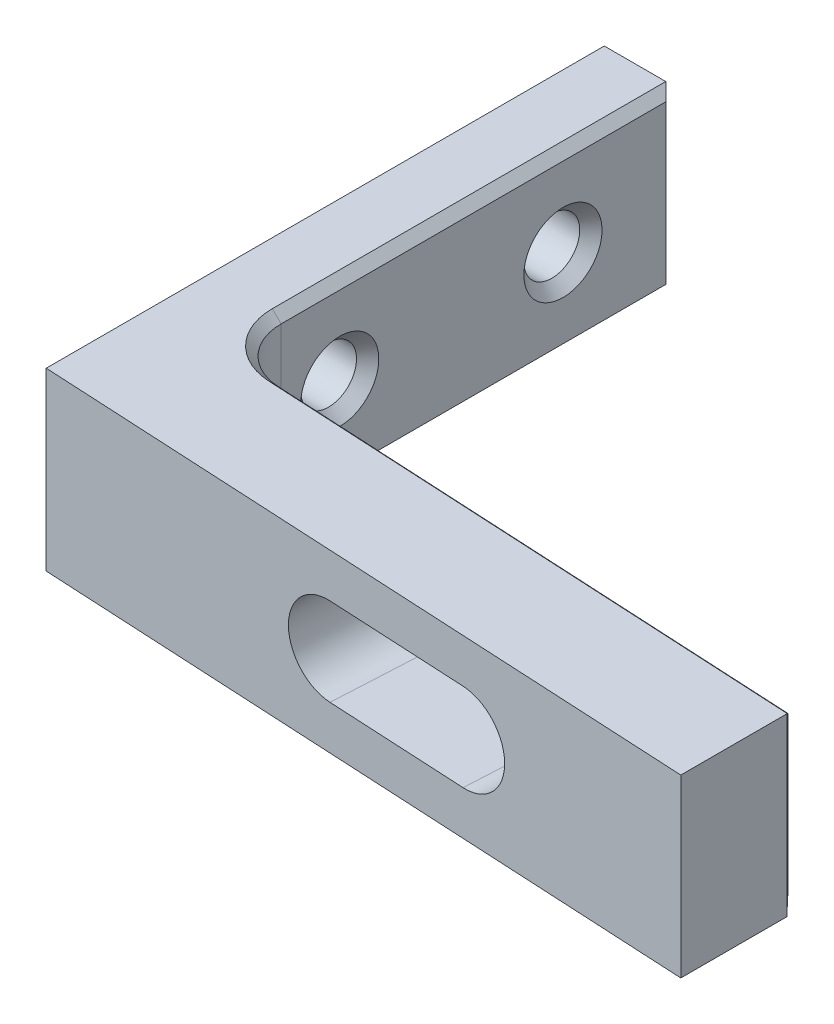
ISO-10303-21;
HEADER;
FILE_DESCRIPTION(('STEP AP214'),'2;1');
FILE_NAME('part.step','',(''),(''),'','','');
FILE_SCHEMA(('AUTOMOTIVE_DESIGN { 1 0 10303 214 1 1 1 1 }'));
ENDSEC;
DATA;
#1=APPLICATION_CONTEXT('core data for automotive mechanical design processes');
#2=APPLICATION_PROTOCOL_DEFINITION('international standard','automotive_design',2000,#1);
#3=PRODUCT_CONTEXT('',#1,'mechanical');
#4=PRODUCT('Part','Part','',(#3));
#5=PRODUCT_RELATED_PRODUCT_CATEGORY('part','',(#4));
#6=PRODUCT_DEFINITION_FORMATION('','',#4);
#7=PRODUCT_DEFINITION_CONTEXT('part definition',#1,'design');
#8=PRODUCT_DEFINITION('design','',#6,#7);
#9=PRODUCT_DEFINITION_SHAPE('','',#8);
#10=(LENGTH_UNIT() NAMED_UNIT(*) SI_UNIT(.MILLI.,.METRE.));
#11=(NAMED_UNIT(*) PLANE_ANGLE_UNIT() SI_UNIT($,.RADIAN.));
#12=(NAMED_UNIT(*) SI_UNIT($,.STERADIAN.) SOLID_ANGLE_UNIT());
#13=UNCERTAINTY_MEASURE_WITH_UNIT(LENGTH_MEASURE(1.E-05),#10,'distance_accuracy_value','');
#14=(GEOMETRIC_REPRESENTATION_CONTEXT(3) GLOBAL_UNCERTAINTY_ASSIGNED_CONTEXT((#13)) GLOBAL_UNIT_ASSIGNED_CONTEXT((#10,
#11,#12)) REPRESENTATION_CONTEXT('',''));
#15=CARTESIAN_POINT('',(0.,0.,0.));
#16=DIRECTION('',(0.,0.,1.));
#17=DIRECTION('',(1.,0.,0.));
#18=AXIS2_PLACEMENT_3D('',#15,#16,#17);
#19=CARTESIAN_POINT('',(19.05,10.,15.875));
#20=DIRECTION('',(-1.,0.,0.));
#21=DIRECTION('',(0.,0.,1.));
#22=AXIS2_PLACEMENT_3D('',#19,#20,#21);
#23=PLANE('',#22);
#24=DIRECTION('',(0.,0.,-1.));
#25=VECTOR('',#24,1.);
#26=CARTESIAN_POINT('',(19.05,0.,15.875));
#27=LINE('',#26,#25);
#28=CARTESIAN_POINT('',(19.05,0.,17.8717363906839));
#29=VERTEX_POINT('',#28);
#30=CARTESIAN_POINT('',(19.05,0.,11.8404825249185));
#31=VERTEX_POINT('',#30);
#32=EDGE_CURVE('E211',#29,#31,#27,.T.);
#33=ORIENTED_EDGE('',*,*,#32,.T.);
#34=DIRECTION('',(0.,1.,0.));
#35=VECTOR('',#34,1.);
#36=CARTESIAN_POINT('',(19.05,10.,11.8404825249185));
#37=LINE('',#36,#35);
#38=CARTESIAN_POINT('',(19.05,10.,11.8404825249185));
#39=VERTEX_POINT('',#38);
#40=EDGE_CURVE('E40',#31,#39,#37,.T.);
#41=ORIENTED_EDGE('',*,*,#40,.T.);
#42=DIRECTION('',(0.,0.,-1.));
#43=VECTOR('',#42,1.);
#44=CARTESIAN_POINT('',(19.05,10.,15.875));
#45=LINE('',#44,#43);
#46=CARTESIAN_POINT('',(19.05,10.,17.8717363906839));
#47=VERTEX_POINT('',#46);
#48=EDGE_CURVE('E212',#47,#39,#45,.T.);
#49=ORIENTED_EDGE('',*,*,#48,.F.);
#50=DIRECTION('',(0.,1.,0.));
#51=VECTOR('',#50,1.);
#52=CARTESIAN_POINT('',(19.05,10.,17.8717363906839));
#53=LINE('',#52,#51);
#54=EDGE_CURVE('E231',#47,#29,#53,.F.);
#55=ORIENTED_EDGE('',*,*,#54,.T.);
#56=EDGE_LOOP('',(#33,#41,#49,#55));
#57=FACE_BOUND('',#56,.T.);
#58=ADVANCED_FACE('F31',(#57),#23,.F.);
#59=CARTESIAN_POINT('',(-19.05,10.,-15.875));
#60=DIRECTION('',(0.,0.,1.));
#61=DIRECTION('',(1.,0.,0.));
#62=AXIS2_PLACEMENT_3D('',#59,#60,#61);
#63=PLANE('',#62);
#64=DIRECTION('',(-1.,0.,0.));
#65=VECTOR('',#64,1.);
#66=CARTESIAN_POINT('',(-19.05,10.,-15.875));
#67=LINE('',#66,#65);
#68=CARTESIAN_POINT('',(-15.55,10.,-15.875));
#69=VERTEX_POINT('',#68);
#70=CARTESIAN_POINT('',(-19.05,10.,-15.875));
#71=VERTEX_POINT('',#70);
#72=EDGE_CURVE('E215',#69,#71,#67,.T.);
#73=ORIENTED_EDGE('',*,*,#72,.F.);
#74=DIRECTION('',(0.,-1.,0.));
#75=VECTOR('',#74,1.);
#76=CARTESIAN_POINT('',(-15.55,10.,-15.875));
#77=LINE('',#76,#75);
#78=CARTESIAN_POINT('',(-15.55,0.,-15.875));
#79=VERTEX_POINT('',#78);
#80=EDGE_CURVE('E11',#69,#79,#77,.T.);
#81=ORIENTED_EDGE('',*,*,#80,.T.);
#82=DIRECTION('',(-1.,0.,0.));
#83=VECTOR('',#82,1.);
#84=CARTESIAN_POINT('',(-19.05,0.,-15.875));
#85=LINE('',#84,#83);
#86=CARTESIAN_POINT('',(-19.05,0.,-15.875));
#87=VERTEX_POINT('',#86);
#88=EDGE_CURVE('E223',#79,#87,#85,.T.);
#89=ORIENTED_EDGE('',*,*,#88,.T.);
#90=DIRECTION('',(0.,-1.,0.));
#91=VECTOR('',#90,1.);
#92=CARTESIAN_POINT('',(-19.05,10.,-15.875));
#93=LINE('',#92,#91);
#94=EDGE_CURVE('E230',#71,#87,#93,.T.);
#95=ORIENTED_EDGE('',*,*,#94,.F.);
#96=EDGE_LOOP('',(#73,#81,#89,#95));
#97=FACE_BOUND('',#96,.T.);
#98=ADVANCED_FACE('F367',(#97),#63,.F.);
#99=CARTESIAN_POINT('',(-19.05,10.,15.875));
#100=DIRECTION('',(1.,0.,0.));
#101=DIRECTION('',(0.,0.,-1.));
#102=AXIS2_PLACEMENT_3D('',#99,#100,#101);
#103=PLANE('',#102);
#104=CARTESIAN_POINT('',(-19.05,5.,-9.525));
#105=DIRECTION('',(-1.,0.,0.));
#106=DIRECTION('',(0.,0.,1.));
#107=AXIS2_PLACEMENT_3D('',#104,#105,#106);
#108=CIRCLE('',#107,2.2225);
#109=CARTESIAN_POINT('',(-19.05,5.,-7.3025));
#110=VERTEX_POINT('',#109);
#111=EDGE_CURVE('E186',#110,#110,#108,.T.);
#112=ORIENTED_EDGE('',*,*,#111,.F.);
#113=EDGE_LOOP('',(#112));
#114=FACE_BOUND('',#113,.T.);
#115=CARTESIAN_POINT('',(-19.05,5.,3.175));
#116=DIRECTION('',(-1.,0.,0.));
#117=DIRECTION('',(0.,0.,1.));
#118=AXIS2_PLACEMENT_3D('',#115,#116,#117);
#119=CIRCLE('',#118,2.2225);
#120=CARTESIAN_POINT('',(-19.05,5.,5.3975));
#121=VERTEX_POINT('',#120);
#122=EDGE_CURVE('E202',#121,#121,#119,.T.);
#123=ORIENTED_EDGE('',*,*,#122,.F.);
#124=EDGE_LOOP('',(#123));
#125=FACE_BOUND('',#124,.T.);
#126=DIRECTION('',(0.,0.,1.));
#127=VECTOR('',#126,1.);
#128=CARTESIAN_POINT('',(-19.05,0.,15.875));
#129=LINE('',#128,#127);
#130=CARTESIAN_POINT('',(-19.05,0.,15.875));
#131=VERTEX_POINT('',#130);
#132=EDGE_CURVE('E225',#87,#131,#129,.T.);
#133=ORIENTED_EDGE('',*,*,#132,.T.);
#134=DIRECTION('',(0.,-1.,0.));
#135=VECTOR('',#134,1.);
#136=CARTESIAN_POINT('',(-19.05,10.,15.875));
#137=LINE('',#136,#135);
#138=CARTESIAN_POINT('',(-19.05,10.,15.875));
#139=VERTEX_POINT('',#138);
#140=EDGE_CURVE('E227',#139,#131,#137,.T.);
#141=ORIENTED_EDGE('',*,*,#140,.F.);
#142=DIRECTION('',(0.,0.,1.));
#143=VECTOR('',#142,1.);
#144=CARTESIAN_POINT('',(-19.05,10.,15.875));
#145=LINE('',#144,#143);
#146=EDGE_CURVE('E218',#71,#139,#145,.T.);
#147=ORIENTED_EDGE('',*,*,#146,.F.);
#148=ORIENTED_EDGE('',*,*,#94,.T.);
#149=EDGE_LOOP('',(#133,#141,#147,#148));
#150=FACE_BOUND('',#149,.T.);
#151=ADVANCED_FACE('F376',(#114,#125,#150),#103,.F.);
#152=CARTESIAN_POINT('',(-19.05,10.,15.875));
#153=DIRECTION('',(-0.0523359562429439,0.,0.998629534754574));
#154=DIRECTION('',(0.998629534754574,0.,0.052335956242944));
#155=AXIS2_PLACEMENT_3D('',#152,#153,#154);
#156=PLANE('',#155);
#157=DIRECTION('',(-0.998629534754574,0.,-0.052335956242944));
#158=VECTOR('',#157,1.);
#159=CARTESIAN_POINT('',(-19.05,7.5,15.875));
#160=LINE('',#159,#158);
#161=CARTESIAN_POINT('',(-2.01119831442696,7.5,16.767965757985));
#162=VERTEX_POINT('',#161);
#163=CARTESIAN_POINT('',(5.97783796360963,7.5,17.1866534079286));
#164=VERTEX_POINT('',#163);
#165=EDGE_CURVE('E182',#162,#164,#160,.F.);
#166=ORIENTED_EDGE('',*,*,#165,.T.);
#167=CARTESIAN_POINT('',(5.97783796360963,5.,17.1866534079286));
#168=DIRECTION('',(-0.0523359562429439,0.,0.998629534754574));
#169=DIRECTION('',(0.998629534754574,0.,0.052335956242944));
#170=AXIS2_PLACEMENT_3D('',#167,#168,#169);
#171=CIRCLE('',#170,2.5);
#172=CARTESIAN_POINT('',(5.97783796360963,2.5,17.1866534079286));
#173=VERTEX_POINT('',#172);
#174=EDGE_CURVE('E173',#164,#173,#171,.F.);
#175=ORIENTED_EDGE('',*,*,#174,.T.);
#176=DIRECTION('',(0.998629534754574,0.,0.052335956242944));
#177=VECTOR('',#176,1.);
#178=CARTESIAN_POINT('',(-19.05,2.5,15.875));
#179=LINE('',#178,#177);
#180=CARTESIAN_POINT('',(-2.01119831442696,2.5,16.767965757985));
#181=VERTEX_POINT('',#180);
#182=EDGE_CURVE('E156',#173,#181,#179,.F.);
#183=ORIENTED_EDGE('',*,*,#182,.T.);
#184=CARTESIAN_POINT('',(-2.01119831442696,5.,16.767965757985));
#185=DIRECTION('',(-0.0523359562429439,0.,0.998629534754574));
#186=DIRECTION('',(0.998629534754574,0.,0.052335956242944));
#187=AXIS2_PLACEMENT_3D('',#184,#185,#186);
#188=CIRCLE('',#187,2.5);
#189=EDGE_CURVE('E167',#181,#162,#188,.F.);
#190=ORIENTED_EDGE('',*,*,#189,.T.);
#191=EDGE_LOOP('',(#166,#175,#183,#190));
#192=FACE_BOUND('',#191,.T.);
#193=DIRECTION('',(-0.998629534754574,0.,-0.052335956242944));
#194=VECTOR('',#193,1.);
#195=CARTESIAN_POINT('',(17.2862527523916,0.,17.7793023142201));
#196=LINE('',#195,#194);
#197=EDGE_CURVE('E216',#131,#29,#196,.F.);
#198=ORIENTED_EDGE('',*,*,#197,.T.);
#199=ORIENTED_EDGE('',*,*,#54,.F.);
#200=DIRECTION('',(-0.998629534754574,0.,-0.052335956242944));
#201=VECTOR('',#200,1.);
#202=CARTESIAN_POINT('',(17.2862527523916,10.,17.7793023142201));
#203=LINE('',#202,#201);
#204=EDGE_CURVE('E220',#139,#47,#203,.F.);
#205=ORIENTED_EDGE('',*,*,#204,.F.);
#206=ORIENTED_EDGE('',*,*,#140,.T.);
#207=EDGE_LOOP('',(#198,#199,#205,#206));
#208=FACE_BOUND('',#207,.T.);
#209=ADVANCED_FACE('F180',(#192,#208),#156,.T.);
#210=CARTESIAN_POINT('',(19.05,10.,-15.875));
#211=DIRECTION('',(0.,-1.,0.));
#212=DIRECTION('',(0.,0.,-1.));
#213=AXIS2_PLACEMENT_3D('',#210,#211,#212);
#214=PLANE('',#213);
#215=CARTESIAN_POINT('',(-11.875,10.,6.51203750068026));
#216=DIRECTION('',(0.,-1.,0.));
#217=DIRECTION('',(0.,0.,-1.));
#218=AXIS2_PLACEMENT_3D('',#215,#216,#217);
#219=CIRCLE('',#218,3.675);
#220=CARTESIAN_POINT('',(-12.0673346391928,10.,10.1820010409033));
#221=VERTEX_POINT('',#220);
#222=CARTESIAN_POINT('',(-15.55,10.,6.51203750068026));
#223=VERTEX_POINT('',#222);
#224=EDGE_CURVE('E48',#221,#223,#219,.T.);
#225=ORIENTED_EDGE('',*,*,#224,.T.);
#226=DIRECTION('',(0.,0.,-1.));
#227=VECTOR('',#226,1.);
#228=CARTESIAN_POINT('',(-15.55,10.,-15.875));
#229=LINE('',#228,#227);
#230=EDGE_CURVE('E300',#223,#69,#229,.T.);
#231=ORIENTED_EDGE('',*,*,#230,.T.);
#232=ORIENTED_EDGE('',*,*,#72,.T.);
#233=ORIENTED_EDGE('',*,*,#146,.T.);
#234=ORIENTED_EDGE('',*,*,#204,.T.);
#235=ORIENTED_EDGE('',*,*,#48,.T.);
#236=DIRECTION('',(0.669130606358862,0.,0.743144825477391));
#237=VECTOR('',#236,1.);
#238=CARTESIAN_POINT('',(19.05,10.,11.8404825249185));
#239=LINE('',#238,#237);
#240=CARTESIAN_POINT('',(19.0238320218785,10.,11.811420040929));
#241=VERTEX_POINT('',#240);
#242=EDGE_CURVE('E296',#39,#241,#239,.F.);
#243=ORIENTED_EDGE('',*,*,#242,.T.);
#244=DIRECTION('',(-0.998629534754574,0.,-0.0523359562429439));
#245=VECTOR('',#244,1.);
#246=CARTESIAN_POINT('',(17.6029188544084,10.,11.7369531372679));
#247=LINE('',#246,#245);
#248=EDGE_CURVE('E53',#241,#221,#247,.T.);
#249=ORIENTED_EDGE('',*,*,#248,.T.);
#250=EDGE_LOOP('',(#225,#231,#232,#233,#234,#235,#243,#249));
#251=FACE_BOUND('',#250,.T.);
#252=ADVANCED_FACE('F381',(#251),#214,.F.);
#253=CARTESIAN_POINT('',(19.05,0.,-15.875));
#254=DIRECTION('',(0.,-1.,0.));
#255=DIRECTION('',(0.,0.,-1.));
#256=AXIS2_PLACEMENT_3D('',#253,#254,#255);
#257=PLANE('',#256);
#258=ORIENTED_EDGE('',*,*,#88,.F.);
#259=DIRECTION('',(0.,0.,1.));
#260=VECTOR('',#259,1.);
#261=CARTESIAN_POINT('',(-15.55,0.,6.51203750068026));
#262=LINE('',#261,#260);
#263=CARTESIAN_POINT('',(-15.55,0.,6.51203750068026));
#264=VERTEX_POINT('',#263);
#265=EDGE_CURVE('E276',#79,#264,#262,.T.);
#266=ORIENTED_EDGE('',*,*,#265,.T.);
#267=CARTESIAN_POINT('',(-11.875,0.,6.51203750068026));
#268=DIRECTION('',(0.,-1.,0.));
#269=DIRECTION('',(0.,0.,-1.));
#270=AXIS2_PLACEMENT_3D('',#267,#268,#269);
#271=CIRCLE('',#270,3.67499999999999);
#272=CARTESIAN_POINT('',(-12.0673346391928,0.,10.1820010409033));
#273=VERTEX_POINT('',#272);
#274=EDGE_CURVE('E274',#264,#273,#271,.F.);
#275=ORIENTED_EDGE('',*,*,#274,.T.);
#276=DIRECTION('',(0.998629534754574,0.,0.0523359562429439));
#277=VECTOR('',#276,1.);
#278=CARTESIAN_POINT('',(19.0238320218785,0.,11.811420040929));
#279=LINE('',#278,#277);
#280=CARTESIAN_POINT('',(19.0238320218785,0.,11.811420040929));
#281=VERTEX_POINT('',#280);
#282=EDGE_CURVE('E272',#273,#281,#279,.T.);
#283=ORIENTED_EDGE('',*,*,#282,.T.);
#284=DIRECTION('',(-0.669130606358862,0.,-0.743144825477391));
#285=VECTOR('',#284,1.);
#286=CARTESIAN_POINT('',(5.26817289413589,0.,-3.46578713606626));
#287=LINE('',#286,#285);
#288=EDGE_CURVE('E261',#281,#31,#287,.F.);
#289=ORIENTED_EDGE('',*,*,#288,.T.);
#290=ORIENTED_EDGE('',*,*,#32,.F.);
#291=ORIENTED_EDGE('',*,*,#197,.F.);
#292=ORIENTED_EDGE('',*,*,#132,.F.);
#293=EDGE_LOOP('',(#258,#266,#275,#283,#289,#290,#291,#292));
#294=FACE_BOUND('',#293,.T.);
#295=ADVANCED_FACE('F371',(#294),#257,.T.);
#296=CARTESIAN_POINT('',(-15.05,-0.000999999999999265,-15.875));
#297=DIRECTION('',(-1.,0.,0.));
#298=DIRECTION('',(0.,0.,1.));
#299=AXIS2_PLACEMENT_3D('',#296,#297,#298);
#300=PLANE('',#299);
#301=DIRECTION('',(0.,1.,0.));
#302=VECTOR('',#301,1.);
#303=CARTESIAN_POINT('',(-15.05,0.,6.51203750068026));
#304=LINE('',#303,#302);
#305=CARTESIAN_POINT('',(-15.05,9.5,6.51203750068026));
#306=VERTEX_POINT('',#305);
#307=CARTESIAN_POINT('',(-15.05,0.499999999999987,6.51203750068026));
#308=VERTEX_POINT('',#307);
#309=EDGE_CURVE('E241',#306,#308,#304,.F.);
#310=ORIENTED_EDGE('',*,*,#309,.T.);
#311=DIRECTION('',(0.,0.,-1.));
#312=VECTOR('',#311,1.);
#313=CARTESIAN_POINT('',(-15.05,0.499999999999987,-15.875));
#314=LINE('',#313,#312);
#315=CARTESIAN_POINT('',(-15.05,0.499999999999987,-15.375));
#316=VERTEX_POINT('',#315);
#317=EDGE_CURVE('E283',#308,#316,#314,.T.);
#318=ORIENTED_EDGE('',*,*,#317,.T.);
#319=DIRECTION('',(0.,1.,0.));
#320=VECTOR('',#319,1.);
#321=CARTESIAN_POINT('',(-15.05,-0.000999999999999265,-15.375));
#322=LINE('',#321,#320);
#323=CARTESIAN_POINT('',(-15.05,9.5,-15.375));
#324=VERTEX_POINT('',#323);
#325=EDGE_CURVE('E279',#316,#324,#322,.T.);
#326=ORIENTED_EDGE('',*,*,#325,.T.);
#327=DIRECTION('',(0.,0.,1.));
#328=VECTOR('',#327,1.);
#329=CARTESIAN_POINT('',(-15.05,9.5,-15.875));
#330=LINE('',#329,#328);
#331=EDGE_CURVE('E281',#324,#306,#330,.T.);
#332=ORIENTED_EDGE('',*,*,#331,.T.);
#333=EDGE_LOOP('',(#310,#318,#326,#332));
#334=FACE_BOUND('',#333,.T.);
#335=CARTESIAN_POINT('',(-15.05,5.,-9.525));
#336=DIRECTION('',(-1.,0.,0.));
#337=DIRECTION('',(0.,0.,1.));
#338=AXIS2_PLACEMENT_3D('',#335,#336,#337);
#339=CIRCLE('',#338,2.2225);
#340=CARTESIAN_POINT('',(-15.05,5.,-7.3025));
#341=VERTEX_POINT('',#340);
#342=EDGE_CURVE('E183',#341,#341,#339,.T.);
#343=ORIENTED_EDGE('',*,*,#342,.T.);
#344=EDGE_LOOP('',(#343));
#345=FACE_BOUND('',#344,.T.);
#346=CARTESIAN_POINT('',(-15.05,5.,3.175));
#347=DIRECTION('',(-1.,0.,0.));
#348=DIRECTION('',(0.,0.,1.));
#349=AXIS2_PLACEMENT_3D('',#346,#347,#348);
#350=CIRCLE('',#349,2.2225);
#351=CARTESIAN_POINT('',(-15.05,5.,5.3975));
#352=VERTEX_POINT('',#351);
#353=EDGE_CURVE('E199',#352,#352,#350,.T.);
#354=ORIENTED_EDGE('',*,*,#353,.T.);
#355=EDGE_LOOP('',(#354));
#356=FACE_BOUND('',#355,.T.);
#357=ADVANCED_FACE('F354',(#334,#345,#356),#300,.F.);
#358=CARTESIAN_POINT('',(-15.685,5.,3.175));
#359=DIRECTION('',(1.,0.,0.));
#360=DIRECTION('',(0.,0.,-1.));
#361=AXIS2_PLACEMENT_3D('',#358,#359,#360);
#362=CONICAL_SURFACE('',#361,1.5875,0.785398163397448);
#363=ORIENTED_EDGE('',*,*,#353,.F.);
#364=EDGE_LOOP('',(#363));
#365=FACE_BOUND('',#364,.T.);
#366=CARTESIAN_POINT('',(-15.685,5.,3.175));
#367=DIRECTION('',(-1.,0.,0.));
#368=DIRECTION('',(0.,0.,1.));
#369=AXIS2_PLACEMENT_3D('',#366,#367,#368);
#370=CIRCLE('',#369,1.5875);
#371=CARTESIAN_POINT('',(-15.685,5.,4.7625));
#372=VERTEX_POINT('',#371);
#373=EDGE_CURVE('E208',#372,#372,#370,.T.);
#374=ORIENTED_EDGE('',*,*,#373,.T.);
#375=EDGE_LOOP('',(#374));
#376=FACE_BOUND('',#375,.T.);
#377=ADVANCED_FACE('F531',(#365,#376),#362,.F.);
#378=CARTESIAN_POINT('',(-19.05,5.,3.175));
#379=DIRECTION('',(-1.,0.,0.));
#380=DIRECTION('',(0.,0.,1.));
#381=AXIS2_PLACEMENT_3D('',#378,#379,#380);
#382=CYLINDRICAL_SURFACE('',#381,1.5875);
#383=ORIENTED_EDGE('',*,*,#373,.F.);
#384=EDGE_LOOP('',(#383));
#385=FACE_BOUND('',#384,.T.);
#386=CARTESIAN_POINT('',(-18.415,5.,3.175));
#387=DIRECTION('',(-1.,0.,0.));
#388=DIRECTION('',(0.,0.,1.));
#389=AXIS2_PLACEMENT_3D('',#386,#387,#388);
#390=CIRCLE('',#389,1.5875);
#391=CARTESIAN_POINT('',(-18.415,5.,4.7625));
#392=VERTEX_POINT('',#391);
#393=EDGE_CURVE('E205',#392,#392,#390,.T.);
#394=ORIENTED_EDGE('',*,*,#393,.T.);
#395=EDGE_LOOP('',(#394));
#396=FACE_BOUND('',#395,.T.);
#397=ADVANCED_FACE('F523',(#385,#396),#382,.F.);
#398=CARTESIAN_POINT('',(-19.05,5.,3.175));
#399=DIRECTION('',(-1.,0.,0.));
#400=DIRECTION('',(0.,0.,1.));
#401=AXIS2_PLACEMENT_3D('',#398,#399,#400);
#402=CONICAL_SURFACE('',#401,2.2225,0.785398163397448);
#403=ORIENTED_EDGE('',*,*,#393,.F.);
#404=EDGE_LOOP('',(#403));
#405=FACE_BOUND('',#404,.T.);
#406=ORIENTED_EDGE('',*,*,#122,.T.);
#407=EDGE_LOOP('',(#406));
#408=FACE_BOUND('',#407,.T.);
#409=ADVANCED_FACE('F515',(#405,#408),#402,.F.);
#410=CARTESIAN_POINT('',(-15.685,5.,-9.525));
#411=DIRECTION('',(1.,0.,0.));
#412=DIRECTION('',(0.,0.,-1.));
#413=AXIS2_PLACEMENT_3D('',#410,#411,#412);
#414=CONICAL_SURFACE('',#413,1.5875,0.785398163397448);
#415=ORIENTED_EDGE('',*,*,#342,.F.);
#416=EDGE_LOOP('',(#415));
#417=FACE_BOUND('',#416,.T.);
#418=CARTESIAN_POINT('',(-15.685,5.,-9.525));
#419=DIRECTION('',(-1.,0.,0.));
#420=DIRECTION('',(0.,0.,1.));
#421=AXIS2_PLACEMENT_3D('',#418,#419,#420);
#422=CIRCLE('',#421,1.5875);
#423=CARTESIAN_POINT('',(-15.685,5.,-7.9375));
#424=VERTEX_POINT('',#423);
#425=EDGE_CURVE('E196',#424,#424,#422,.T.);
#426=ORIENTED_EDGE('',*,*,#425,.T.);
#427=EDGE_LOOP('',(#426));
#428=FACE_BOUND('',#427,.T.);
#429=ADVANCED_FACE('F507',(#417,#428),#414,.F.);
#430=CARTESIAN_POINT('',(-19.05,5.,-9.525));
#431=DIRECTION('',(-1.,0.,0.));
#432=DIRECTION('',(0.,0.,1.));
#433=AXIS2_PLACEMENT_3D('',#430,#431,#432);
#434=CYLINDRICAL_SURFACE('',#433,1.5875);
#435=ORIENTED_EDGE('',*,*,#425,.F.);
#436=EDGE_LOOP('',(#435));
#437=FACE_BOUND('',#436,.T.);
#438=CARTESIAN_POINT('',(-18.415,5.,-9.525));
#439=DIRECTION('',(-1.,0.,0.));
#440=DIRECTION('',(0.,0.,1.));
#441=AXIS2_PLACEMENT_3D('',#438,#439,#440);
#442=CIRCLE('',#441,1.5875);
#443=CARTESIAN_POINT('',(-18.415,5.,-7.9375));
#444=VERTEX_POINT('',#443);
#445=EDGE_CURVE('E193',#444,#444,#442,.T.);
#446=ORIENTED_EDGE('',*,*,#445,.T.);
#447=EDGE_LOOP('',(#446));
#448=FACE_BOUND('',#447,.T.);
#449=ADVANCED_FACE('F500',(#437,#448),#434,.F.);
#450=CARTESIAN_POINT('',(-19.05,5.,-9.525));
#451=DIRECTION('',(-1.,0.,0.));
#452=DIRECTION('',(0.,0.,1.));
#453=AXIS2_PLACEMENT_3D('',#450,#451,#452);
#454=CONICAL_SURFACE('',#453,2.2225,0.785398163397448);
#455=ORIENTED_EDGE('',*,*,#445,.F.);
#456=EDGE_LOOP('',(#455));
#457=FACE_BOUND('',#456,.T.);
#458=ORIENTED_EDGE('',*,*,#111,.T.);
#459=EDGE_LOOP('',(#458));
#460=FACE_BOUND('',#459,.T.);
#461=ADVANCED_FACE('F489',(#457,#460),#454,.F.);
#462=CARTESIAN_POINT('',(-15.05,0.,9.525));
#463=DIRECTION('',(-0.0523359562429439,0.,0.998629534754574));
#464=DIRECTION('',(0.998629534754574,0.,0.0523359562429439));
#465=AXIS2_PLACEMENT_3D('',#462,#463,#464);
#466=PLANE('',#465);
#467=CARTESIAN_POINT('',(6.32067204374788,5.,10.644989463599));
#468=DIRECTION('',(-0.0523359562429439,0.,0.998629534754574));
#469=DIRECTION('',(0.998629534754574,0.,0.0523359562429439));
#470=AXIS2_PLACEMENT_3D('',#467,#468,#469);
#471=CIRCLE('',#470,3.);
#472=CARTESIAN_POINT('',(6.32067204374788,2.,10.644989463599));
#473=VERTEX_POINT('',#472);
#474=CARTESIAN_POINT('',(6.32067204374788,8.,10.644989463599));
#475=VERTEX_POINT('',#474);
#476=EDGE_CURVE('E251',#473,#475,#471,.T.);
#477=ORIENTED_EDGE('',*,*,#476,.T.);
#478=DIRECTION('',(-0.998629534754574,0.,-0.0523359562429439));
#479=VECTOR('',#478,1.);
#480=CARTESIAN_POINT('',(-15.05,8.,9.525));
#481=LINE('',#480,#479);
#482=CARTESIAN_POINT('',(-1.66836423428871,8.,10.2263018136554));
#483=VERTEX_POINT('',#482);
#484=EDGE_CURVE('E253',#475,#483,#481,.T.);
#485=ORIENTED_EDGE('',*,*,#484,.T.);
#486=CARTESIAN_POINT('',(-1.66836423428871,5.,10.2263018136554));
#487=DIRECTION('',(-0.0523359562429439,0.,0.998629534754574));
#488=DIRECTION('',(0.998629534754574,0.,0.0523359562429439));
#489=AXIS2_PLACEMENT_3D('',#486,#487,#488);
#490=CIRCLE('',#489,3.);
#491=CARTESIAN_POINT('',(-1.66836423428871,2.,10.2263018136554));
#492=VERTEX_POINT('',#491);
#493=EDGE_CURVE('E249',#483,#492,#490,.T.);
#494=ORIENTED_EDGE('',*,*,#493,.T.);
#495=DIRECTION('',(0.998629534754574,0.,0.0523359562429439));
#496=VECTOR('',#495,1.);
#497=CARTESIAN_POINT('',(-15.05,2.,9.525));
#498=LINE('',#497,#496);
#499=EDGE_CURVE('E247',#492,#473,#498,.T.);
#500=ORIENTED_EDGE('',*,*,#499,.T.);
#501=EDGE_LOOP('',(#477,#485,#494,#500));
#502=FACE_BOUND('',#501,.T.);
#503=DIRECTION('',(0.,-1.,0.));
#504=VECTOR('',#503,1.);
#505=CARTESIAN_POINT('',(18.5506852326227,0.,11.2859372954302));
#506=LINE('',#505,#504);
#507=CARTESIAN_POINT('',(18.5506852326227,9.5,11.2859372954302));
#508=VERTEX_POINT('',#507);
#509=CARTESIAN_POINT('',(18.5506852326227,0.499999999999986,11.2859372954302));
#510=VERTEX_POINT('',#509);
#511=EDGE_CURVE('E290',#508,#510,#506,.T.);
#512=ORIENTED_EDGE('',*,*,#511,.T.);
#513=DIRECTION('',(-0.998629534754574,0.,-0.0523359562429439));
#514=VECTOR('',#513,1.);
#515=CARTESIAN_POINT('',(-12.0411666610713,0.499999999999986,9.68268627352603));
#516=LINE('',#515,#514);
#517=CARTESIAN_POINT('',(-12.0411666610713,0.499999999999987,9.68268627352603));
#518=VERTEX_POINT('',#517);
#519=EDGE_CURVE('E294',#510,#518,#516,.T.);
#520=ORIENTED_EDGE('',*,*,#519,.T.);
#521=DIRECTION('',(0.,1.,0.));
#522=VECTOR('',#521,1.);
#523=CARTESIAN_POINT('',(-12.0411666610713,10.,9.68268627352603));
#524=LINE('',#523,#522);
#525=CARTESIAN_POINT('',(-12.0411666610713,9.5,9.68268627352603));
#526=VERTEX_POINT('',#525);
#527=EDGE_CURVE('E234',#518,#526,#524,.T.);
#528=ORIENTED_EDGE('',*,*,#527,.T.);
#529=DIRECTION('',(0.998629534754574,0.,0.0523359562429439));
#530=VECTOR('',#529,1.);
#531=CARTESIAN_POINT('',(-15.05,9.5,9.525));
#532=LINE('',#531,#530);
#533=EDGE_CURVE('E292',#526,#508,#532,.T.);
#534=ORIENTED_EDGE('',*,*,#533,.T.);
#535=EDGE_LOOP('',(#512,#520,#528,#534));
#536=FACE_BOUND('',#535,.T.);
#537=ADVANCED_FACE('F331',(#502,#536),#466,.F.);
#538=CARTESIAN_POINT('',(5.87348007037523,5.,19.1779206331774));
#539=DIRECTION('',(0.052335956242944,0.,-0.998629534754574));
#540=DIRECTION('',(-0.998629534754574,0.,-0.052335956242944));
#541=AXIS2_PLACEMENT_3D('',#538,#539,#540);
#542=CYLINDRICAL_SURFACE('',#541,2.5);
#543=DIRECTION('',(0.052335956242944,0.,-0.998629534754574));
#544=VECTOR('',#543,1.);
#545=CARTESIAN_POINT('',(5.87348007037523,7.5,19.1779206331774));
#546=LINE('',#545,#544);
#547=CARTESIAN_POINT('',(6.29450406562641,7.5,11.1443042309763));
#548=VERTEX_POINT('',#547);
#549=EDGE_CURVE('E168',#164,#548,#546,.T.);
#550=ORIENTED_EDGE('',*,*,#549,.T.);
#551=CARTESIAN_POINT('',(6.29450406562641,5.,11.1443042309763));
#552=DIRECTION('',(-0.0523359562429437,0.,0.998629534754574));
#553=DIRECTION('',(0.998629534754574,0.,0.0523359562429437));
#554=AXIS2_PLACEMENT_3D('',#551,#552,#553);
#555=CIRCLE('',#554,2.5);
#556=CARTESIAN_POINT('',(6.29450406562641,2.5,11.1443042309763));
#557=VERTEX_POINT('',#556);
#558=EDGE_CURVE('E176',#548,#557,#555,.F.);
#559=ORIENTED_EDGE('',*,*,#558,.T.);
#560=DIRECTION('',(0.052335956242944,0.,-0.998629534754574));
#561=VECTOR('',#560,1.);
#562=CARTESIAN_POINT('',(5.87348007037523,2.5,19.1779206331774));
#563=LINE('',#562,#561);
#564=EDGE_CURVE('E159',#173,#557,#563,.T.);
#565=ORIENTED_EDGE('',*,*,#564,.F.);
#566=ORIENTED_EDGE('',*,*,#174,.F.);
#567=EDGE_LOOP('',(#550,#559,#565,#566));
#568=FACE_BOUND('',#567,.T.);
#569=ADVANCED_FACE('F172',(#568),#542,.F.);
#570=CARTESIAN_POINT('',(5.87348007037523,7.5,19.1779206331774));
#571=DIRECTION('',(0.,1.,0.));
#572=DIRECTION('',(0.,0.,1.));
#573=AXIS2_PLACEMENT_3D('',#570,#571,#572);
#574=PLANE('',#573);
#575=DIRECTION('',(0.052335956242944,0.,-0.998629534754574));
#576=VECTOR('',#575,1.);
#577=CARTESIAN_POINT('',(-2.11555620766136,7.5,18.7592329832338));
#578=LINE('',#577,#576);
#579=CARTESIAN_POINT('',(-1.69453221241018,7.5,10.7256165810327));
#580=VERTEX_POINT('',#579);
#581=EDGE_CURVE('E634',#162,#580,#578,.T.);
#582=ORIENTED_EDGE('',*,*,#581,.T.);
#583=DIRECTION('',(0.998629534754574,0.,0.0523359562429439));
#584=VECTOR('',#583,1.);
#585=CARTESIAN_POINT('',(6.29450406562641,7.5,11.1443042309763));
#586=LINE('',#585,#584);
#587=EDGE_CURVE('E244',#580,#548,#586,.T.);
#588=ORIENTED_EDGE('',*,*,#587,.T.);
#589=ORIENTED_EDGE('',*,*,#549,.F.);
#590=ORIENTED_EDGE('',*,*,#165,.F.);
#591=EDGE_LOOP('',(#582,#588,#589,#590));
#592=FACE_BOUND('',#591,.T.);
#593=ADVANCED_FACE('F467',(#592),#574,.F.);
#594=CARTESIAN_POINT('',(-2.11555620766136,5.,18.7592329832338));
#595=DIRECTION('',(0.052335956242944,0.,-0.998629534754574));
#596=DIRECTION('',(-0.998629534754574,0.,-0.052335956242944));
#597=AXIS2_PLACEMENT_3D('',#594,#595,#596);
#598=CYLINDRICAL_SURFACE('',#597,2.5);
#599=DIRECTION('',(0.052335956242944,0.,-0.998629534754574));
#600=VECTOR('',#599,1.);
#601=CARTESIAN_POINT('',(-2.11555620766136,2.5,18.7592329832338));
#602=LINE('',#601,#600);
#603=CARTESIAN_POINT('',(-1.69453221241018,2.5,10.7256165810327));
#604=VERTEX_POINT('',#603);
#605=EDGE_CURVE('E162',#181,#604,#602,.T.);
#606=ORIENTED_EDGE('',*,*,#605,.T.);
#607=CARTESIAN_POINT('',(-1.69453221241018,5.,10.7256165810327));
#608=DIRECTION('',(-0.0523359562429442,0.,0.998629534754574));
#609=DIRECTION('',(0.998629534754574,0.,0.0523359562429442));
#610=AXIS2_PLACEMENT_3D('',#607,#608,#609);
#611=CIRCLE('',#610,2.5);
#612=EDGE_CURVE('E257',#604,#580,#611,.F.);
#613=ORIENTED_EDGE('',*,*,#612,.T.);
#614=ORIENTED_EDGE('',*,*,#581,.F.);
#615=ORIENTED_EDGE('',*,*,#189,.F.);
#616=EDGE_LOOP('',(#606,#613,#614,#615));
#617=FACE_BOUND('',#616,.T.);
#618=ADVANCED_FACE('F461',(#617),#598,.F.);
#619=CARTESIAN_POINT('',(5.87348007037523,2.5,19.1779206331774));
#620=DIRECTION('',(0.,-1.,0.));
#621=DIRECTION('',(0.,0.,-1.));
#622=AXIS2_PLACEMENT_3D('',#619,#620,#621);
#623=PLANE('',#622);
#624=ORIENTED_EDGE('',*,*,#564,.T.);
#625=DIRECTION('',(-0.998629534754574,0.,-0.0523359562429439));
#626=VECTOR('',#625,1.);
#627=CARTESIAN_POINT('',(6.29450406562641,2.5,11.1443042309763));
#628=LINE('',#627,#626);
#629=EDGE_CURVE('E259',#557,#604,#628,.T.);
#630=ORIENTED_EDGE('',*,*,#629,.T.);
#631=ORIENTED_EDGE('',*,*,#605,.F.);
#632=ORIENTED_EDGE('',*,*,#182,.F.);
#633=EDGE_LOOP('',(#624,#630,#631,#632));
#634=FACE_BOUND('',#633,.T.);
#635=ADVANCED_FACE('F158',(#634),#623,.F.);
#636=CARTESIAN_POINT('',(-11.875,0.,6.51203750068026));
#637=DIRECTION('',(0.,-1.,0.));
#638=DIRECTION('',(0.,0.,-1.));
#639=AXIS2_PLACEMENT_3D('',#636,#637,#638);
#640=CYLINDRICAL_SURFACE('',#639,3.175);
#641=ORIENTED_EDGE('',*,*,#527,.F.);
#642=CARTESIAN_POINT('',(-11.875,0.499999999999987,6.51203750068026));
#643=DIRECTION('',(0.,-1.,0.));
#644=DIRECTION('',(0.,0.,-1.));
#645=AXIS2_PLACEMENT_3D('',#642,#643,#644);
#646=CIRCLE('',#645,3.175);
#647=EDGE_CURVE('E288',#518,#308,#646,.T.);
#648=ORIENTED_EDGE('',*,*,#647,.T.);
#649=ORIENTED_EDGE('',*,*,#309,.F.);
#650=CARTESIAN_POINT('',(-11.875,9.5,6.51203750068026));
#651=DIRECTION('',(0.,-1.,0.));
#652=DIRECTION('',(0.,0.,-1.));
#653=AXIS2_PLACEMENT_3D('',#650,#651,#652);
#654=CIRCLE('',#653,3.175);
#655=EDGE_CURVE('E286',#306,#526,#654,.F.);
#656=ORIENTED_EDGE('',*,*,#655,.T.);
#657=EDGE_LOOP('',(#641,#648,#649,#656));
#658=FACE_BOUND('',#657,.T.);
#659=ADVANCED_FACE('F337',(#658),#640,.F.);
#660=CARTESIAN_POINT('',(6.29450406562641,2.5,11.1443042309763));
#661=DIRECTION('',(-0.0370071095592683,-0.707106781186542,0.706137715918131));
#662=DIRECTION('',(0.,-0.706621750184629,-0.707591479715529));
#663=AXIS2_PLACEMENT_3D('',#660,#661,#662);
#664=PLANE('',#663);
#665=DIRECTION('',(-0.0370071095592677,0.707106781186553,0.706137715918121));
#666=VECTOR('',#665,1.);
#667=CARTESIAN_POINT('',(6.32067204374788,2.,10.644989463599));
#668=LINE('',#667,#666);
#669=EDGE_CURVE('E266',#473,#557,#668,.T.);
#670=ORIENTED_EDGE('',*,*,#669,.F.);
#671=ORIENTED_EDGE('',*,*,#499,.F.);
#672=DIRECTION('',(0.0370071095592677,-0.707106781186553,-0.706137715918121));
#673=VECTOR('',#672,1.);
#674=CARTESIAN_POINT('',(-1.69453221241018,2.5,10.7256165810327));
#675=LINE('',#674,#673);
#676=EDGE_CURVE('E177',#604,#492,#675,.T.);
#677=ORIENTED_EDGE('',*,*,#676,.F.);
#678=ORIENTED_EDGE('',*,*,#629,.F.);
#679=EDGE_LOOP('',(#670,#671,#677,#678));
#680=FACE_BOUND('',#679,.T.);
#681=ADVANCED_FACE('F399',(#680),#664,.F.);
#682=CARTESIAN_POINT('',(-1.69453221241018,5.,10.7256165810327));
#683=DIRECTION('',(0.0523359562429442,0.,-0.998629534754574));
#684=DIRECTION('',(-0.998629534754574,0.,-0.0523359562429442));
#685=AXIS2_PLACEMENT_3D('',#682,#683,#684);
#686=CONICAL_SURFACE('',#685,2.5,0.785398163397455);
#687=ORIENTED_EDGE('',*,*,#676,.T.);
#688=ORIENTED_EDGE('',*,*,#493,.F.);
#689=DIRECTION('',(0.0370071095592677,0.707106781186552,-0.706137715918121));
#690=VECTOR('',#689,1.);
#691=CARTESIAN_POINT('',(-1.69453221241018,7.5,10.7256165810327));
#692=LINE('',#691,#690);
#693=EDGE_CURVE('E264',#580,#483,#692,.T.);
#694=ORIENTED_EDGE('',*,*,#693,.F.);
#695=ORIENTED_EDGE('',*,*,#612,.F.);
#696=EDGE_LOOP('',(#687,#688,#694,#695));
#697=FACE_BOUND('',#696,.T.);
#698=ADVANCED_FACE('F407',(#697),#686,.F.);
#699=CARTESIAN_POINT('',(6.29450406562641,5.,11.1443042309763));
#700=DIRECTION('',(0.0523359562429437,0.,-0.998629534754574));
#701=DIRECTION('',(-0.998629534754574,0.,-0.0523359562429437));
#702=AXIS2_PLACEMENT_3D('',#699,#700,#701);
#703=CONICAL_SURFACE('',#702,2.5,0.785398163397455);
#704=ORIENTED_EDGE('',*,*,#669,.T.);
#705=ORIENTED_EDGE('',*,*,#558,.F.);
#706=DIRECTION('',(-0.0370071095592677,-0.707106781186552,0.706137715918121));
#707=VECTOR('',#706,1.);
#708=CARTESIAN_POINT('',(6.32067204374788,8.,10.644989463599));
#709=LINE('',#708,#707);
#710=EDGE_CURVE('E262',#475,#548,#709,.T.);
#711=ORIENTED_EDGE('',*,*,#710,.F.);
#712=ORIENTED_EDGE('',*,*,#476,.F.);
#713=EDGE_LOOP('',(#704,#705,#711,#712));
#714=FACE_BOUND('',#713,.T.);
#715=ADVANCED_FACE('F403',(#714),#703,.F.);
#716=CARTESIAN_POINT('',(6.29450406562641,7.5,11.1443042309763));
#717=DIRECTION('',(-0.0370071095592683,0.707106781186542,0.706137715918131));
#718=DIRECTION('',(0.,-0.706621750184629,0.707591479715529));
#719=AXIS2_PLACEMENT_3D('',#716,#717,#718);
#720=PLANE('',#719);
#721=ORIENTED_EDGE('',*,*,#693,.T.);
#722=ORIENTED_EDGE('',*,*,#484,.F.);
#723=ORIENTED_EDGE('',*,*,#710,.T.);
#724=ORIENTED_EDGE('',*,*,#587,.F.);
#725=EDGE_LOOP('',(#721,#722,#723,#724));
#726=FACE_BOUND('',#725,.T.);
#727=ADVANCED_FACE('F400',(#726),#720,.F.);
#728=CARTESIAN_POINT('',(-15.05,9.5,9.525));
#729=DIRECTION('',(-0.0370071095592679,-0.70710678118655,0.706137715918124));
#730=DIRECTION('',(0.,-0.706621750184621,-0.707591479715536));
#731=AXIS2_PLACEMENT_3D('',#728,#729,#730);
#732=PLANE('',#731);
#733=DIRECTION('',(0.546342852286109,0.577350269189621,0.606775209136424));
#734=VECTOR('',#733,1.);
#735=CARTESIAN_POINT('',(19.0412773406262,10.0184354191382,11.8307950302553));
#736=LINE('',#735,#734);
#737=EDGE_CURVE('E318',#508,#241,#736,.T.);
#738=ORIENTED_EDGE('',*,*,#737,.F.);
#739=ORIENTED_EDGE('',*,*,#533,.F.);
#740=DIRECTION('',(0.0370071095592673,-0.707106781186545,-0.706137715918129));
#741=VECTOR('',#740,1.);
#742=CARTESIAN_POINT('',(-12.0673346391928,10.,10.1820010409033));
#743=LINE('',#742,#741);
#744=EDGE_CURVE('E35',#221,#526,#743,.T.);
#745=ORIENTED_EDGE('',*,*,#744,.F.);
#746=ORIENTED_EDGE('',*,*,#248,.F.);
#747=EDGE_LOOP('',(#738,#739,#745,#746));
#748=FACE_BOUND('',#747,.T.);
#749=ADVANCED_FACE('F33',(#748),#732,.F.);
#750=CARTESIAN_POINT('',(-11.875,10.,6.51203750068026));
#751=DIRECTION('',(0.,1.,0.));
#752=DIRECTION('',(0.,0.,1.));
#753=AXIS2_PLACEMENT_3D('',#750,#751,#752);
#754=CONICAL_SURFACE('',#753,3.675,0.785398163397448);
#755=ORIENTED_EDGE('',*,*,#744,.T.);
#756=ORIENTED_EDGE('',*,*,#655,.F.);
#757=DIRECTION('',(0.707106781186546,-0.707106781186549,0.));
#758=VECTOR('',#757,1.);
#759=CARTESIAN_POINT('',(-15.55,10.,6.51203750068026));
#760=LINE('',#759,#758);
#761=EDGE_CURVE('E316',#223,#306,#760,.T.);
#762=ORIENTED_EDGE('',*,*,#761,.F.);
#763=ORIENTED_EDGE('',*,*,#224,.F.);
#764=EDGE_LOOP('',(#755,#756,#762,#763));
#765=FACE_BOUND('',#764,.T.);
#766=ADVANCED_FACE('F327',(#765),#754,.F.);
#767=CARTESIAN_POINT('',(19.05,10.,11.8404825249185));
#768=DIRECTION('',(-0.743144825477391,0.,0.669130606358862));
#769=DIRECTION('',(0.669130606358862,0.,0.743144825477391));
#770=AXIS2_PLACEMENT_3D('',#767,#768,#769);
#771=PLANE('',#770);
#772=ORIENTED_EDGE('',*,*,#40,.F.);
#773=ORIENTED_EDGE('',*,*,#288,.F.);
#774=DIRECTION('',(0.546342852286109,-0.577350269189622,0.606775209136424));
#775=VECTOR('',#774,1.);
#776=CARTESIAN_POINT('',(15.8869654122541,3.31489791419508,8.32757672693028));
#777=LINE('',#776,#775);
#778=EDGE_CURVE('E313',#510,#281,#777,.T.);
#779=ORIENTED_EDGE('',*,*,#778,.F.);
#780=ORIENTED_EDGE('',*,*,#511,.F.);
#781=ORIENTED_EDGE('',*,*,#737,.T.);
#782=ORIENTED_EDGE('',*,*,#242,.F.);
#783=EDGE_LOOP('',(#772,#773,#779,#780,#781,#782));
#784=FACE_BOUND('',#783,.T.);
#785=ADVANCED_FACE('F384',(#784),#771,.F.);
#786=CARTESIAN_POINT('',(-15.05,9.5,-15.875));
#787=DIRECTION('',(-0.707106781186545,-0.70710678118655,0.));
#788=DIRECTION('',(0.70710678118655,-0.707106781186545,0.));
#789=AXIS2_PLACEMENT_3D('',#786,#787,#788);
#790=PLANE('',#789);
#791=ORIENTED_EDGE('',*,*,#761,.T.);
#792=ORIENTED_EDGE('',*,*,#331,.F.);
#793=DIRECTION('',(0.57735026918963,-0.577350269189626,0.577350269189622));
#794=VECTOR('',#793,1.);
#795=CARTESIAN_POINT('',(-11.883,6.333,-12.208));
#796=LINE('',#795,#794);
#797=EDGE_CURVE('E310',#69,#324,#796,.T.);
#798=ORIENTED_EDGE('',*,*,#797,.F.);
#799=ORIENTED_EDGE('',*,*,#230,.F.);
#800=EDGE_LOOP('',(#791,#792,#798,#799));
#801=FACE_BOUND('',#800,.T.);
#802=ADVANCED_FACE('F359',(#801),#790,.F.);
#803=CARTESIAN_POINT('',(17.6029188544084,0.,11.7369531372678));
#804=DIRECTION('',(0.037007109559268,-0.70710678118655,-0.706137715918124));
#805=DIRECTION('',(0.,0.706621750184622,-0.707591479715536));
#806=AXIS2_PLACEMENT_3D('',#803,#804,#805);
#807=PLANE('',#806);
#808=ORIENTED_EDGE('',*,*,#778,.T.);
#809=ORIENTED_EDGE('',*,*,#282,.F.);
#810=DIRECTION('',(-0.0370071095592683,-0.707106781186545,0.706137715918129));
#811=VECTOR('',#810,1.);
#812=CARTESIAN_POINT('',(-12.0411666610713,0.499999999999986,9.68268627352603));
#813=LINE('',#812,#811);
#814=EDGE_CURVE('E307',#518,#273,#813,.T.);
#815=ORIENTED_EDGE('',*,*,#814,.F.);
#816=ORIENTED_EDGE('',*,*,#519,.F.);
#817=EDGE_LOOP('',(#808,#809,#815,#816));
#818=FACE_BOUND('',#817,.T.);
#819=ADVANCED_FACE('F342',(#818),#807,.T.);
#820=CARTESIAN_POINT('',(-15.05,-0.000999999999999265,-15.375));
#821=DIRECTION('',(-0.707106781186542,0.,0.707106781186552));
#822=DIRECTION('',(0.707106781186552,0.,0.707106781186543));
#823=AXIS2_PLACEMENT_3D('',#820,#821,#822);
#824=PLANE('',#823);
#825=ORIENTED_EDGE('',*,*,#797,.T.);
#826=ORIENTED_EDGE('',*,*,#325,.F.);
#827=DIRECTION('',(0.57735026918963,0.577350269189626,0.577350269189622));
#828=VECTOR('',#827,1.);
#829=CARTESIAN_POINT('',(-15.217,0.332999999999991,-15.542));
#830=LINE('',#829,#828);
#831=EDGE_CURVE('E305',#79,#316,#830,.T.);
#832=ORIENTED_EDGE('',*,*,#831,.F.);
#833=ORIENTED_EDGE('',*,*,#80,.F.);
#834=EDGE_LOOP('',(#825,#826,#832,#833));
#835=FACE_BOUND('',#834,.T.);
#836=ADVANCED_FACE('F363',(#835),#824,.F.);
#837=CARTESIAN_POINT('',(-11.875,0.,6.51203750068026));
#838=DIRECTION('',(0.,-1.,0.));
#839=DIRECTION('',(0.,0.,-1.));
#840=AXIS2_PLACEMENT_3D('',#837,#838,#839);
#841=CONICAL_SURFACE('',#840,3.67499999999999,0.785398163397448);
#842=ORIENTED_EDGE('',*,*,#814,.T.);
#843=ORIENTED_EDGE('',*,*,#274,.F.);
#844=DIRECTION('',(-0.707106781186546,-0.707106781186549,0.));
#845=VECTOR('',#844,1.);
#846=CARTESIAN_POINT('',(-15.05,0.499999999999987,6.51203750068026));
#847=LINE('',#846,#845);
#848=EDGE_CURVE('E303',#308,#264,#847,.T.);
#849=ORIENTED_EDGE('',*,*,#848,.F.);
#850=ORIENTED_EDGE('',*,*,#647,.F.);
#851=EDGE_LOOP('',(#842,#843,#849,#850));
#852=FACE_BOUND('',#851,.T.);
#853=ADVANCED_FACE('F346',(#852),#841,.F.);
#854=CARTESIAN_POINT('',(-15.55,0.,-15.875));
#855=DIRECTION('',(0.707106781186545,-0.70710678118655,0.));
#856=DIRECTION('',(0.70710678118655,0.707106781186545,0.));
#857=AXIS2_PLACEMENT_3D('',#854,#855,#856);
#858=PLANE('',#857);
#859=ORIENTED_EDGE('',*,*,#831,.T.);
#860=ORIENTED_EDGE('',*,*,#317,.F.);
#861=ORIENTED_EDGE('',*,*,#848,.T.);
#862=ORIENTED_EDGE('',*,*,#265,.F.);
#863=EDGE_LOOP('',(#859,#860,#861,#862));
#864=FACE_BOUND('',#863,.T.);
#865=ADVANCED_FACE('F350',(#864),#858,.T.);
#866=CLOSED_SHELL('',(#58,#98,#151,#209,#252,#295,#357,#377,#397,#409,#429,#449,#461,#537,#569,
#593,#618,#635,#659,#681,#698,#715,#727,#749,#766,#785,#802,#819,#836,#853,#865));
#867=MANIFOLD_SOLID_BREP('B2',#866);
#868=ADVANCED_BREP_SHAPE_REPRESENTATION('',(#18,#867),#14);
#869=SHAPE_DEFINITION_REPRESENTATION(#9,#868);
ENDSEC;
END-ISO-10303-21;
